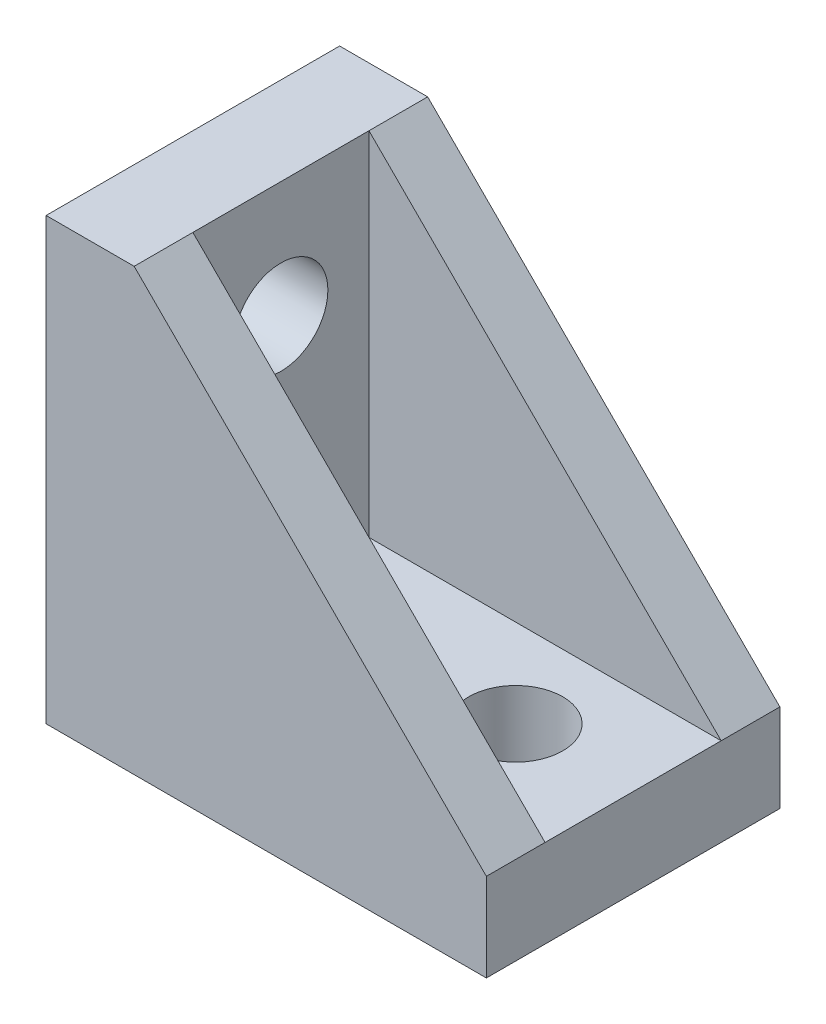
ISO-10303-21;
HEADER;
FILE_DESCRIPTION(('STEP AP214'),'2;1');
FILE_NAME('part.step','',(''),(''),'','','');
FILE_SCHEMA(('AUTOMOTIVE_DESIGN { 1 0 10303 214 1 1 1 1 }'));
ENDSEC;
DATA;
#1=APPLICATION_CONTEXT('core data for automotive mechanical design processes');
#2=APPLICATION_PROTOCOL_DEFINITION('international standard','automotive_design',2000,#1);
#3=PRODUCT_CONTEXT('',#1,'mechanical');
#4=PRODUCT('Part','Part','',(#3));
#5=PRODUCT_RELATED_PRODUCT_CATEGORY('part','',(#4));
#6=PRODUCT_DEFINITION_FORMATION('','',#4);
#7=PRODUCT_DEFINITION_CONTEXT('part definition',#1,'design');
#8=PRODUCT_DEFINITION('design','',#6,#7);
#9=PRODUCT_DEFINITION_SHAPE('','',#8);
#10=(LENGTH_UNIT() NAMED_UNIT(*) SI_UNIT(.MILLI.,.METRE.));
#11=(NAMED_UNIT(*) PLANE_ANGLE_UNIT() SI_UNIT($,.RADIAN.));
#12=(NAMED_UNIT(*) SI_UNIT($,.STERADIAN.) SOLID_ANGLE_UNIT());
#13=UNCERTAINTY_MEASURE_WITH_UNIT(LENGTH_MEASURE(1.E-05),#10,'distance_accuracy_value','');
#14=(GEOMETRIC_REPRESENTATION_CONTEXT(3) GLOBAL_UNCERTAINTY_ASSIGNED_CONTEXT((#13)) GLOBAL_UNIT_ASSIGNED_CONTEXT((#10,
#11,#12)) REPRESENTATION_CONTEXT('',''));
#15=CARTESIAN_POINT('',(0.,0.,0.));
#16=DIRECTION('',(0.,0.,1.));
#17=DIRECTION('',(1.,0.,0.));
#18=AXIS2_PLACEMENT_3D('',#15,#16,#17);
#19=CARTESIAN_POINT('',(3.,0.,3.));
#20=DIRECTION('',(1.,0.,0.));
#21=DIRECTION('',(0.,0.,-1.));
#22=AXIS2_PLACEMENT_3D('',#19,#20,#21);
#23=PLANE('',#22);
#24=CARTESIAN_POINT('',(3.,11.,3.));
#25=DIRECTION('',(1.,0.,0.));
#26=DIRECTION('',(0.,0.,-1.));
#27=AXIS2_PLACEMENT_3D('',#24,#25,#26);
#28=CIRCLE('',#27,1.6);
#29=CARTESIAN_POINT('',(3.,11.,1.4));
#30=VERTEX_POINT('',#29);
#31=EDGE_CURVE('E228',#30,#30,#28,.T.);
#32=ORIENTED_EDGE('',*,*,#31,.F.);
#33=EDGE_LOOP('',(#32));
#34=FACE_BOUND('',#33,.T.);
#35=DIRECTION('',(0.,-1.,0.));
#36=VECTOR('',#35,1.);
#37=CARTESIAN_POINT('',(3.,0.,0.));
#38=LINE('',#37,#36);
#39=CARTESIAN_POINT('',(3.,15.,0.));
#40=VERTEX_POINT('',#39);
#41=CARTESIAN_POINT('',(3.,3.,0.));
#42=VERTEX_POINT('',#41);
#43=EDGE_CURVE('E180',#40,#42,#38,.T.);
#44=ORIENTED_EDGE('',*,*,#43,.F.);
#45=DIRECTION('',(0.,0.,-1.));
#46=VECTOR('',#45,1.);
#47=CARTESIAN_POINT('',(3.,15.,3.));
#48=LINE('',#47,#46);
#49=CARTESIAN_POINT('',(3.,15.,6.));
#50=VERTEX_POINT('',#49);
#51=EDGE_CURVE('E11',#50,#40,#48,.T.);
#52=ORIENTED_EDGE('',*,*,#51,.F.);
#53=DIRECTION('',(0.,-1.,0.));
#54=VECTOR('',#53,1.);
#55=CARTESIAN_POINT('',(3.,0.,6.));
#56=LINE('',#55,#54);
#57=CARTESIAN_POINT('',(3.,3.,6.));
#58=VERTEX_POINT('',#57);
#59=EDGE_CURVE('E141',#50,#58,#56,.T.);
#60=ORIENTED_EDGE('',*,*,#59,.T.);
#61=DIRECTION('',(0.,0.,-1.));
#62=VECTOR('',#61,1.);
#63=CARTESIAN_POINT('',(3.,3.,3.));
#64=LINE('',#63,#62);
#65=EDGE_CURVE('E60',#58,#42,#64,.T.);
#66=ORIENTED_EDGE('',*,*,#65,.T.);
#67=EDGE_LOOP('',(#44,#52,#60,#66));
#68=FACE_BOUND('',#67,.T.);
#69=ADVANCED_FACE('F45',(#34,#68),#23,.T.);
#70=CARTESIAN_POINT('',(0.,15.,3.));
#71=DIRECTION('',(0.,1.,0.));
#72=DIRECTION('',(0.,0.,1.));
#73=AXIS2_PLACEMENT_3D('',#70,#71,#72);
#74=PLANE('',#73);
#75=ORIENTED_EDGE('',*,*,#51,.T.);
#76=DIRECTION('',(0.,0.,1.));
#77=VECTOR('',#76,1.);
#78=CARTESIAN_POINT('',(3.,15.,-2.));
#79=LINE('',#78,#77);
#80=CARTESIAN_POINT('',(3.,15.,-2.));
#81=VERTEX_POINT('',#80);
#82=EDGE_CURVE('E176',#81,#40,#79,.T.);
#83=ORIENTED_EDGE('',*,*,#82,.F.);
#84=DIRECTION('',(1.,0.,0.));
#85=VECTOR('',#84,1.);
#86=CARTESIAN_POINT('',(0.,15.,-2.));
#87=LINE('',#86,#85);
#88=CARTESIAN_POINT('',(0.,15.,-2.));
#89=VERTEX_POINT('',#88);
#90=EDGE_CURVE('E161',#89,#81,#87,.T.);
#91=ORIENTED_EDGE('',*,*,#90,.F.);
#92=DIRECTION('',(0.,0.,-1.));
#93=VECTOR('',#92,1.);
#94=CARTESIAN_POINT('',(0.,15.,3.));
#95=LINE('',#94,#93);
#96=CARTESIAN_POINT('',(0.,15.,8.));
#97=VERTEX_POINT('',#96);
#98=EDGE_CURVE('E53',#97,#89,#95,.T.);
#99=ORIENTED_EDGE('',*,*,#98,.F.);
#100=DIRECTION('',(1.,0.,0.));
#101=VECTOR('',#100,1.);
#102=CARTESIAN_POINT('',(0.,15.,8.));
#103=LINE('',#102,#101);
#104=CARTESIAN_POINT('',(3.,15.,8.));
#105=VERTEX_POINT('',#104);
#106=EDGE_CURVE('E120',#97,#105,#103,.T.);
#107=ORIENTED_EDGE('',*,*,#106,.T.);
#108=DIRECTION('',(0.,0.,-1.));
#109=VECTOR('',#108,1.);
#110=CARTESIAN_POINT('',(3.,15.,8.));
#111=LINE('',#110,#109);
#112=EDGE_CURVE('E115',#105,#50,#111,.T.);
#113=ORIENTED_EDGE('',*,*,#112,.T.);
#114=EDGE_LOOP('',(#75,#83,#91,#99,#107,#113));
#115=FACE_BOUND('',#114,.T.);
#116=ADVANCED_FACE('F208',(#115),#74,.T.);
#117=CARTESIAN_POINT('',(0.,0.,3.));
#118=DIRECTION('',(-1.,0.,0.));
#119=DIRECTION('',(0.,0.,1.));
#120=AXIS2_PLACEMENT_3D('',#117,#118,#119);
#121=PLANE('',#120);
#122=CARTESIAN_POINT('',(0.,11.,3.));
#123=DIRECTION('',(1.,0.,0.));
#124=DIRECTION('',(0.,0.,-1.));
#125=AXIS2_PLACEMENT_3D('',#122,#123,#124);
#126=CIRCLE('',#125,1.6);
#127=CARTESIAN_POINT('',(0.,11.,1.4));
#128=VERTEX_POINT('',#127);
#129=EDGE_CURVE('E222',#128,#128,#126,.T.);
#130=ORIENTED_EDGE('',*,*,#129,.T.);
#131=EDGE_LOOP('',(#130));
#132=FACE_BOUND('',#131,.T.);
#133=ORIENTED_EDGE('',*,*,#98,.T.);
#134=DIRECTION('',(0.,1.,0.));
#135=VECTOR('',#134,1.);
#136=CARTESIAN_POINT('',(0.,0.,-2.));
#137=LINE('',#136,#135);
#138=CARTESIAN_POINT('',(0.,0.,-2.));
#139=VERTEX_POINT('',#138);
#140=EDGE_CURVE('E164',#139,#89,#137,.T.);
#141=ORIENTED_EDGE('',*,*,#140,.F.);
#142=DIRECTION('',(0.,0.,-1.));
#143=VECTOR('',#142,1.);
#144=CARTESIAN_POINT('',(0.,0.,3.));
#145=LINE('',#144,#143);
#146=CARTESIAN_POINT('',(0.,0.,8.));
#147=VERTEX_POINT('',#146);
#148=EDGE_CURVE('E197',#147,#139,#145,.T.);
#149=ORIENTED_EDGE('',*,*,#148,.F.);
#150=DIRECTION('',(0.,1.,0.));
#151=VECTOR('',#150,1.);
#152=CARTESIAN_POINT('',(0.,0.,8.));
#153=LINE('',#152,#151);
#154=EDGE_CURVE('E143',#147,#97,#153,.T.);
#155=ORIENTED_EDGE('',*,*,#154,.T.);
#156=EDGE_LOOP('',(#133,#141,#149,#155));
#157=FACE_BOUND('',#156,.T.);
#158=ADVANCED_FACE('F203',(#132,#157),#121,.T.);
#159=CARTESIAN_POINT('',(0.,0.,3.));
#160=DIRECTION('',(0.,-1.,0.));
#161=DIRECTION('',(1.,0.,0.));
#162=AXIS2_PLACEMENT_3D('',#159,#160,#161);
#163=PLANE('',#162);
#164=CARTESIAN_POINT('',(11.,0.,3.));
#165=DIRECTION('',(0.,-1.,0.));
#166=DIRECTION('',(0.,0.,-1.));
#167=AXIS2_PLACEMENT_3D('',#164,#165,#166);
#168=CIRCLE('',#167,1.6);
#169=CARTESIAN_POINT('',(11.,0.,1.4));
#170=VERTEX_POINT('',#169);
#171=EDGE_CURVE('E234',#170,#170,#168,.T.);
#172=ORIENTED_EDGE('',*,*,#171,.F.);
#173=EDGE_LOOP('',(#172));
#174=FACE_BOUND('',#173,.T.);
#175=ORIENTED_EDGE('',*,*,#148,.T.);
#176=DIRECTION('',(-1.,0.,0.));
#177=VECTOR('',#176,1.);
#178=CARTESIAN_POINT('',(0.,0.,-2.));
#179=LINE('',#178,#177);
#180=CARTESIAN_POINT('',(15.0000000000001,0.,-2.));
#181=VERTEX_POINT('',#180);
#182=EDGE_CURVE('E168',#181,#139,#179,.T.);
#183=ORIENTED_EDGE('',*,*,#182,.F.);
#184=DIRECTION('',(0.,0.,-1.));
#185=VECTOR('',#184,1.);
#186=CARTESIAN_POINT('',(15.0000000000001,0.,3.));
#187=LINE('',#186,#185);
#188=CARTESIAN_POINT('',(15.0000000000001,0.,8.));
#189=VERTEX_POINT('',#188);
#190=EDGE_CURVE('E194',#189,#181,#187,.T.);
#191=ORIENTED_EDGE('',*,*,#190,.F.);
#192=DIRECTION('',(-1.,0.,0.));
#193=VECTOR('',#192,1.);
#194=CARTESIAN_POINT('',(0.,0.,8.));
#195=LINE('',#194,#193);
#196=EDGE_CURVE('E128',#189,#147,#195,.T.);
#197=ORIENTED_EDGE('',*,*,#196,.T.);
#198=EDGE_LOOP('',(#175,#183,#191,#197));
#199=FACE_BOUND('',#198,.T.);
#200=ADVANCED_FACE('F216',(#174,#199),#163,.T.);
#201=CARTESIAN_POINT('',(15.0000000000001,0.,3.));
#202=DIRECTION('',(1.,0.,0.));
#203=DIRECTION('',(0.,1.,0.));
#204=AXIS2_PLACEMENT_3D('',#201,#202,#203);
#205=PLANE('',#204);
#206=ORIENTED_EDGE('',*,*,#190,.T.);
#207=DIRECTION('',(0.,-1.,0.));
#208=VECTOR('',#207,1.);
#209=CARTESIAN_POINT('',(15.0000000000001,0.,-2.));
#210=LINE('',#209,#208);
#211=CARTESIAN_POINT('',(15.0000000000001,3.,-2.));
#212=VERTEX_POINT('',#211);
#213=EDGE_CURVE('E154',#212,#181,#210,.T.);
#214=ORIENTED_EDGE('',*,*,#213,.F.);
#215=DIRECTION('',(0.,0.,1.));
#216=VECTOR('',#215,1.);
#217=CARTESIAN_POINT('',(15.0000000000001,3.,-2.));
#218=LINE('',#217,#216);
#219=CARTESIAN_POINT('',(15.0000000000001,3.,0.));
#220=VERTEX_POINT('',#219);
#221=EDGE_CURVE('E172',#212,#220,#218,.T.);
#222=ORIENTED_EDGE('',*,*,#221,.T.);
#223=DIRECTION('',(0.,0.,-1.));
#224=VECTOR('',#223,1.);
#225=CARTESIAN_POINT('',(15.0000000000001,3.,3.));
#226=LINE('',#225,#224);
#227=CARTESIAN_POINT('',(15.0000000000001,3.,6.));
#228=VERTEX_POINT('',#227);
#229=EDGE_CURVE('E135',#228,#220,#226,.T.);
#230=ORIENTED_EDGE('',*,*,#229,.F.);
#231=DIRECTION('',(0.,0.,-1.));
#232=VECTOR('',#231,1.);
#233=CARTESIAN_POINT('',(15.0000000000001,3.,8.));
#234=LINE('',#233,#232);
#235=CARTESIAN_POINT('',(15.0000000000001,3.,8.));
#236=VERTEX_POINT('',#235);
#237=EDGE_CURVE('E114',#236,#228,#234,.T.);
#238=ORIENTED_EDGE('',*,*,#237,.F.);
#239=DIRECTION('',(0.,-1.,0.));
#240=VECTOR('',#239,1.);
#241=CARTESIAN_POINT('',(15.0000000000001,0.,8.));
#242=LINE('',#241,#240);
#243=EDGE_CURVE('E121',#236,#189,#242,.T.);
#244=ORIENTED_EDGE('',*,*,#243,.T.);
#245=EDGE_LOOP('',(#206,#214,#222,#230,#238,#244));
#246=FACE_BOUND('',#245,.T.);
#247=ADVANCED_FACE('F133',(#246),#205,.T.);
#248=CARTESIAN_POINT('',(0.,3.,3.));
#249=DIRECTION('',(0.,1.,0.));
#250=DIRECTION('',(0.,0.,1.));
#251=AXIS2_PLACEMENT_3D('',#248,#249,#250);
#252=PLANE('',#251);
#253=CARTESIAN_POINT('',(11.,3.00000000000012,3.));
#254=DIRECTION('',(0.,-1.,0.));
#255=DIRECTION('',(0.,0.,-1.));
#256=AXIS2_PLACEMENT_3D('',#253,#254,#255);
#257=CIRCLE('',#256,1.6);
#258=CARTESIAN_POINT('',(11.,3.00000000000012,1.4));
#259=VERTEX_POINT('',#258);
#260=EDGE_CURVE('E237',#259,#259,#257,.T.);
#261=ORIENTED_EDGE('',*,*,#260,.T.);
#262=EDGE_LOOP('',(#261));
#263=FACE_BOUND('',#262,.T.);
#264=DIRECTION('',(1.,0.,0.));
#265=VECTOR('',#264,1.);
#266=CARTESIAN_POINT('',(0.,3.,0.));
#267=LINE('',#266,#265);
#268=EDGE_CURVE('E186',#42,#220,#267,.T.);
#269=ORIENTED_EDGE('',*,*,#268,.F.);
#270=ORIENTED_EDGE('',*,*,#65,.F.);
#271=DIRECTION('',(1.,0.,0.));
#272=VECTOR('',#271,1.);
#273=CARTESIAN_POINT('',(0.,3.,6.));
#274=LINE('',#273,#272);
#275=EDGE_CURVE('E149',#58,#228,#274,.T.);
#276=ORIENTED_EDGE('',*,*,#275,.T.);
#277=ORIENTED_EDGE('',*,*,#229,.T.);
#278=EDGE_LOOP('',(#269,#270,#276,#277));
#279=FACE_BOUND('',#278,.T.);
#280=ADVANCED_FACE('F255',(#263,#279),#252,.T.);
#281=CARTESIAN_POINT('',(8.99999999999998,9.00000000000008,-2.));
#282=DIRECTION('',(-0.707106781186544,-0.707106781186552,0.));
#283=DIRECTION('',(0.707106781186552,-0.707106781186544,0.));
#284=AXIS2_PLACEMENT_3D('',#281,#282,#283);
#285=PLANE('',#284);
#286=DIRECTION('',(0.707106781186552,-0.707106781186544,0.));
#287=VECTOR('',#286,1.);
#288=CARTESIAN_POINT('',(8.99999999999998,9.00000000000008,0.));
#289=LINE('',#288,#287);
#290=EDGE_CURVE('E153',#40,#220,#289,.T.);
#291=ORIENTED_EDGE('',*,*,#290,.T.);
#292=ORIENTED_EDGE('',*,*,#221,.F.);
#293=DIRECTION('',(0.707106781186552,-0.707106781186544,0.));
#294=VECTOR('',#293,1.);
#295=CARTESIAN_POINT('',(8.99999999999998,9.00000000000008,-2.));
#296=LINE('',#295,#294);
#297=EDGE_CURVE('E158',#81,#212,#296,.T.);
#298=ORIENTED_EDGE('',*,*,#297,.F.);
#299=ORIENTED_EDGE('',*,*,#82,.T.);
#300=EDGE_LOOP('',(#291,#292,#298,#299));
#301=FACE_BOUND('',#300,.T.);
#302=ADVANCED_FACE('F213',(#301),#285,.F.);
#303=CARTESIAN_POINT('',(0.,0.,-2.));
#304=DIRECTION('',(0.,0.,1.));
#305=DIRECTION('',(1.,0.,0.));
#306=AXIS2_PLACEMENT_3D('',#303,#304,#305);
#307=PLANE('',#306);
#308=ORIENTED_EDGE('',*,*,#213,.T.);
#309=ORIENTED_EDGE('',*,*,#182,.T.);
#310=ORIENTED_EDGE('',*,*,#140,.T.);
#311=ORIENTED_EDGE('',*,*,#90,.T.);
#312=ORIENTED_EDGE('',*,*,#297,.T.);
#313=EDGE_LOOP('',(#308,#309,#310,#311,#312));
#314=FACE_BOUND('',#313,.T.);
#315=ADVANCED_FACE('F206',(#314),#307,.F.);
#316=CARTESIAN_POINT('',(0.,0.,0.));
#317=DIRECTION('',(0.,0.,1.));
#318=DIRECTION('',(1.,0.,0.));
#319=AXIS2_PLACEMENT_3D('',#316,#317,#318);
#320=PLANE('',#319);
#321=ORIENTED_EDGE('',*,*,#290,.F.);
#322=ORIENTED_EDGE('',*,*,#43,.T.);
#323=ORIENTED_EDGE('',*,*,#268,.T.);
#324=EDGE_LOOP('',(#321,#322,#323));
#325=FACE_BOUND('',#324,.T.);
#326=ADVANCED_FACE('F267',(#325),#320,.T.);
#327=CARTESIAN_POINT('',(8.99999999999998,9.00000000000008,8.));
#328=DIRECTION('',(-0.707106781186544,-0.707106781186552,0.));
#329=DIRECTION('',(0.707106781186552,-0.707106781186544,0.));
#330=AXIS2_PLACEMENT_3D('',#327,#328,#329);
#331=PLANE('',#330);
#332=DIRECTION('',(0.707106781186552,-0.707106781186544,0.));
#333=VECTOR('',#332,1.);
#334=CARTESIAN_POINT('',(8.99999999999998,9.00000000000008,6.));
#335=LINE('',#334,#333);
#336=EDGE_CURVE('E131',#50,#228,#335,.T.);
#337=ORIENTED_EDGE('',*,*,#336,.F.);
#338=ORIENTED_EDGE('',*,*,#112,.F.);
#339=DIRECTION('',(0.707106781186552,-0.707106781186544,0.));
#340=VECTOR('',#339,1.);
#341=CARTESIAN_POINT('',(8.99999999999998,9.00000000000008,8.));
#342=LINE('',#341,#340);
#343=EDGE_CURVE('E109',#105,#236,#342,.T.);
#344=ORIENTED_EDGE('',*,*,#343,.T.);
#345=ORIENTED_EDGE('',*,*,#237,.T.);
#346=EDGE_LOOP('',(#337,#338,#344,#345));
#347=FACE_BOUND('',#346,.T.);
#348=ADVANCED_FACE('F112',(#347),#331,.F.);
#349=CARTESIAN_POINT('',(0.,0.,8.));
#350=DIRECTION('',(0.,0.,-1.));
#351=DIRECTION('',(1.,0.,0.));
#352=AXIS2_PLACEMENT_3D('',#349,#350,#351);
#353=PLANE('',#352);
#354=ORIENTED_EDGE('',*,*,#243,.F.);
#355=ORIENTED_EDGE('',*,*,#343,.F.);
#356=ORIENTED_EDGE('',*,*,#106,.F.);
#357=ORIENTED_EDGE('',*,*,#154,.F.);
#358=ORIENTED_EDGE('',*,*,#196,.F.);
#359=EDGE_LOOP('',(#354,#355,#356,#357,#358));
#360=FACE_BOUND('',#359,.T.);
#361=ADVANCED_FACE('F125',(#360),#353,.F.);
#362=CARTESIAN_POINT('',(0.,0.,6.));
#363=DIRECTION('',(0.,0.,-1.));
#364=DIRECTION('',(1.,0.,0.));
#365=AXIS2_PLACEMENT_3D('',#362,#363,#364);
#366=PLANE('',#365);
#367=ORIENTED_EDGE('',*,*,#336,.T.);
#368=ORIENTED_EDGE('',*,*,#275,.F.);
#369=ORIENTED_EDGE('',*,*,#59,.F.);
#370=EDGE_LOOP('',(#367,#368,#369));
#371=FACE_BOUND('',#370,.T.);
#372=ADVANCED_FACE('F269',(#371),#366,.T.);
#373=CARTESIAN_POINT('',(0.,11.,3.));
#374=DIRECTION('',(1.,0.,0.));
#375=DIRECTION('',(0.,0.,-1.));
#376=AXIS2_PLACEMENT_3D('',#373,#374,#375);
#377=CYLINDRICAL_SURFACE('',#376,1.6);
#378=ORIENTED_EDGE('',*,*,#129,.F.);
#379=EDGE_LOOP('',(#378));
#380=FACE_BOUND('',#379,.T.);
#381=ORIENTED_EDGE('',*,*,#31,.T.);
#382=EDGE_LOOP('',(#381));
#383=FACE_BOUND('',#382,.T.);
#384=ADVANCED_FACE('F270',(#380,#383),#377,.F.);
#385=CARTESIAN_POINT('',(11.,0.,3.));
#386=DIRECTION('',(0.,1.,0.));
#387=DIRECTION('',(-1.,0.,0.));
#388=AXIS2_PLACEMENT_3D('',#385,#386,#387);
#389=CYLINDRICAL_SURFACE('',#388,1.6);
#390=ORIENTED_EDGE('',*,*,#171,.T.);
#391=EDGE_LOOP('',(#390));
#392=FACE_BOUND('',#391,.T.);
#393=ORIENTED_EDGE('',*,*,#260,.F.);
#394=EDGE_LOOP('',(#393));
#395=FACE_BOUND('',#394,.T.);
#396=ADVANCED_FACE('F245',(#392,#395),#389,.F.);
#397=CLOSED_SHELL('',(#69,#116,#158,#200,#247,#280,#302,#315,#326,#348,#361,#372,#384,#396));
#398=MANIFOLD_SOLID_BREP('B2',#397);
#399=ADVANCED_BREP_SHAPE_REPRESENTATION('',(#18,#398),#14);
#400=SHAPE_DEFINITION_REPRESENTATION(#9,#399);
ENDSEC;
END-ISO-10303-21;
